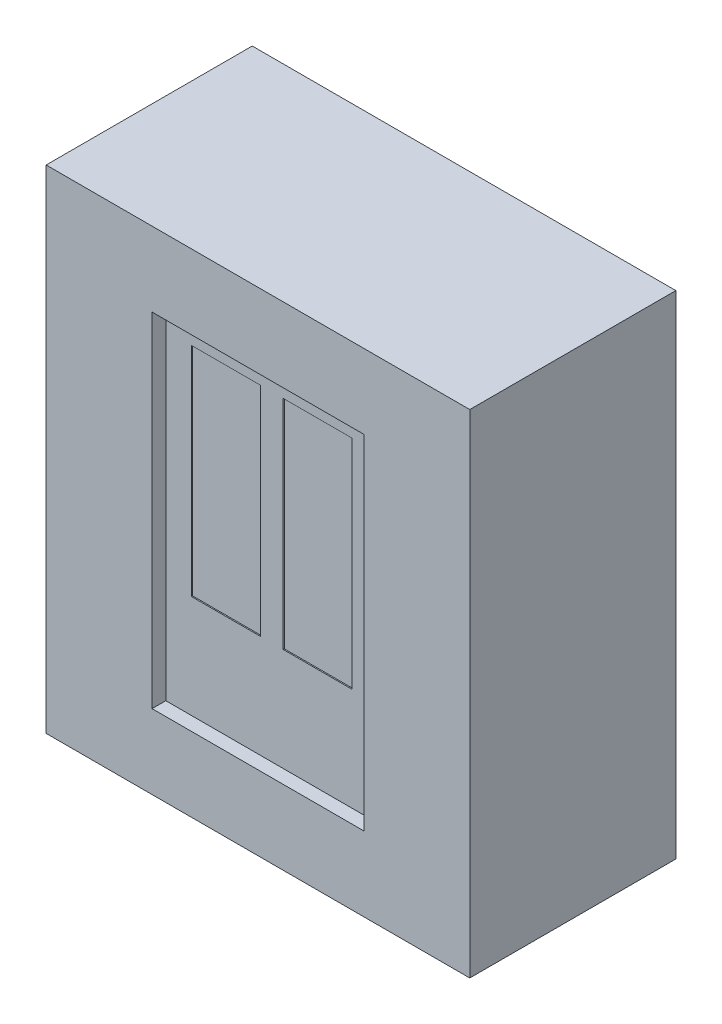
ISO-10303-21;
HEADER;
FILE_DESCRIPTION(('STEP AP214'),'2;1');
FILE_NAME('part.step','',(''),(''),'','','');
FILE_SCHEMA(('AUTOMOTIVE_DESIGN { 1 0 10303 214 1 1 1 1 }'));
ENDSEC;
DATA;
#1=APPLICATION_CONTEXT('core data for automotive mechanical design processes');
#2=APPLICATION_PROTOCOL_DEFINITION('international standard','automotive_design',2000,#1);
#3=PRODUCT_CONTEXT('',#1,'mechanical');
#4=PRODUCT('Part','Part','',(#3));
#5=PRODUCT_RELATED_PRODUCT_CATEGORY('part','',(#4));
#6=PRODUCT_DEFINITION_FORMATION('','',#4);
#7=PRODUCT_DEFINITION_CONTEXT('part definition',#1,'design');
#8=PRODUCT_DEFINITION('design','',#6,#7);
#9=PRODUCT_DEFINITION_SHAPE('','',#8);
#10=(LENGTH_UNIT() NAMED_UNIT(*) SI_UNIT(.MILLI.,.METRE.));
#11=(NAMED_UNIT(*) PLANE_ANGLE_UNIT() SI_UNIT($,.RADIAN.));
#12=(NAMED_UNIT(*) SI_UNIT($,.STERADIAN.) SOLID_ANGLE_UNIT());
#13=UNCERTAINTY_MEASURE_WITH_UNIT(LENGTH_MEASURE(1.E-05),#10,'distance_accuracy_value','');
#14=(GEOMETRIC_REPRESENTATION_CONTEXT(3) GLOBAL_UNCERTAINTY_ASSIGNED_CONTEXT((#13)) GLOBAL_UNIT_ASSIGNED_CONTEXT((#10,
#11,#12)) REPRESENTATION_CONTEXT('',''));
#15=CARTESIAN_POINT('',(0.,0.,0.));
#16=DIRECTION('',(0.,0.,1.));
#17=DIRECTION('',(1.,0.,0.));
#18=AXIS2_PLACEMENT_3D('',#15,#16,#17);
#19=CARTESIAN_POINT('',(0.,0.,180.));
#20=DIRECTION('',(1.,0.,0.));
#21=DIRECTION('',(0.,1.,0.));
#22=AXIS2_PLACEMENT_3D('',#19,#20,#21);
#23=PLANE('',#22);
#24=DIRECTION('',(0.,-1.,0.));
#25=VECTOR('',#24,1.);
#26=CARTESIAN_POINT('',(0.,0.,0.));
#27=LINE('',#26,#25);
#28=CARTESIAN_POINT('',(0.,0.,0.));
#29=VERTEX_POINT('',#28);
#30=CARTESIAN_POINT('',(0.,-430.,0.));
#31=VERTEX_POINT('',#30);
#32=EDGE_CURVE('E239',#29,#31,#27,.T.);
#33=ORIENTED_EDGE('',*,*,#32,.T.);
#34=DIRECTION('',(0.,0.,-1.));
#35=VECTOR('',#34,1.);
#36=CARTESIAN_POINT('',(0.,-430.,180.));
#37=LINE('',#36,#35);
#38=CARTESIAN_POINT('',(0.,-430.,180.));
#39=VERTEX_POINT('',#38);
#40=EDGE_CURVE('E11',#39,#31,#37,.T.);
#41=ORIENTED_EDGE('',*,*,#40,.F.);
#42=DIRECTION('',(0.,-1.,0.));
#43=VECTOR('',#42,1.);
#44=CARTESIAN_POINT('',(0.,0.,180.));
#45=LINE('',#44,#43);
#46=CARTESIAN_POINT('',(0.,0.,180.));
#47=VERTEX_POINT('',#46);
#48=EDGE_CURVE('E246',#47,#39,#45,.T.);
#49=ORIENTED_EDGE('',*,*,#48,.F.);
#50=DIRECTION('',(0.,0.,-1.));
#51=VECTOR('',#50,1.);
#52=CARTESIAN_POINT('',(0.,0.,180.));
#53=LINE('',#52,#51);
#54=EDGE_CURVE('E256',#47,#29,#53,.T.);
#55=ORIENTED_EDGE('',*,*,#54,.T.);
#56=EDGE_LOOP('',(#33,#41,#49,#55));
#57=FACE_BOUND('',#56,.T.);
#58=ADVANCED_FACE('F33',(#57),#23,.F.);
#59=CARTESIAN_POINT('',(0.,-430.,180.));
#60=DIRECTION('',(0.,1.,0.));
#61=DIRECTION('',(0.,0.,1.));
#62=AXIS2_PLACEMENT_3D('',#59,#60,#61);
#63=PLANE('',#62);
#64=DIRECTION('',(1.,0.,0.));
#65=VECTOR('',#64,1.);
#66=CARTESIAN_POINT('',(0.,-430.,0.));
#67=LINE('',#66,#65);
#68=CARTESIAN_POINT('',(370.,-430.,0.));
#69=VERTEX_POINT('',#68);
#70=EDGE_CURVE('E259',#31,#69,#67,.T.);
#71=ORIENTED_EDGE('',*,*,#70,.T.);
#72=DIRECTION('',(0.,0.,-1.));
#73=VECTOR('',#72,1.);
#74=CARTESIAN_POINT('',(370.,-430.,180.));
#75=LINE('',#74,#73);
#76=CARTESIAN_POINT('',(370.,-430.,180.));
#77=VERTEX_POINT('',#76);
#78=EDGE_CURVE('E40',#77,#69,#75,.T.);
#79=ORIENTED_EDGE('',*,*,#78,.F.);
#80=DIRECTION('',(1.,0.,0.));
#81=VECTOR('',#80,1.);
#82=CARTESIAN_POINT('',(0.,-430.,180.));
#83=LINE('',#82,#81);
#84=EDGE_CURVE('E249',#39,#77,#83,.T.);
#85=ORIENTED_EDGE('',*,*,#84,.F.);
#86=ORIENTED_EDGE('',*,*,#40,.T.);
#87=EDGE_LOOP('',(#71,#79,#85,#86));
#88=FACE_BOUND('',#87,.T.);
#89=ADVANCED_FACE('F289',(#88),#63,.F.);
#90=CARTESIAN_POINT('',(370.,0.,180.));
#91=DIRECTION('',(-1.,0.,0.));
#92=DIRECTION('',(0.,-1.,0.));
#93=AXIS2_PLACEMENT_3D('',#90,#91,#92);
#94=PLANE('',#93);
#95=DIRECTION('',(0.,1.,0.));
#96=VECTOR('',#95,1.);
#97=CARTESIAN_POINT('',(370.,0.,0.));
#98=LINE('',#97,#96);
#99=CARTESIAN_POINT('',(370.,0.,0.));
#100=VERTEX_POINT('',#99);
#101=EDGE_CURVE('E261',#69,#100,#98,.T.);
#102=ORIENTED_EDGE('',*,*,#101,.T.);
#103=DIRECTION('',(0.,0.,-1.));
#104=VECTOR('',#103,1.);
#105=CARTESIAN_POINT('',(370.,0.,180.));
#106=LINE('',#105,#104);
#107=CARTESIAN_POINT('',(370.,0.,180.));
#108=VERTEX_POINT('',#107);
#109=EDGE_CURVE('E266',#108,#100,#106,.T.);
#110=ORIENTED_EDGE('',*,*,#109,.F.);
#111=DIRECTION('',(0.,1.,0.));
#112=VECTOR('',#111,1.);
#113=CARTESIAN_POINT('',(370.,0.,180.));
#114=LINE('',#113,#112);
#115=EDGE_CURVE('E252',#77,#108,#114,.T.);
#116=ORIENTED_EDGE('',*,*,#115,.F.);
#117=ORIENTED_EDGE('',*,*,#78,.T.);
#118=EDGE_LOOP('',(#102,#110,#116,#117));
#119=FACE_BOUND('',#118,.T.);
#120=ADVANCED_FACE('F273',(#119),#94,.F.);
#121=CARTESIAN_POINT('',(0.,0.,180.));
#122=DIRECTION('',(0.,-1.,0.));
#123=DIRECTION('',(0.,0.,-1.));
#124=AXIS2_PLACEMENT_3D('',#121,#122,#123);
#125=PLANE('',#124);
#126=DIRECTION('',(-1.,0.,0.));
#127=VECTOR('',#126,1.);
#128=CARTESIAN_POINT('',(0.,0.,0.));
#129=LINE('',#128,#127);
#130=EDGE_CURVE('E250',#100,#29,#129,.T.);
#131=ORIENTED_EDGE('',*,*,#130,.T.);
#132=ORIENTED_EDGE('',*,*,#54,.F.);
#133=DIRECTION('',(-1.,0.,0.));
#134=VECTOR('',#133,1.);
#135=CARTESIAN_POINT('',(0.,0.,180.));
#136=LINE('',#135,#134);
#137=EDGE_CURVE('E254',#108,#47,#136,.T.);
#138=ORIENTED_EDGE('',*,*,#137,.F.);
#139=ORIENTED_EDGE('',*,*,#109,.T.);
#140=EDGE_LOOP('',(#131,#132,#138,#139));
#141=FACE_BOUND('',#140,.T.);
#142=ADVANCED_FACE('F282',(#141),#125,.F.);
#143=CARTESIAN_POINT('',(0.,0.,180.));
#144=DIRECTION('',(0.,0.,1.));
#145=DIRECTION('',(1.,0.,0.));
#146=AXIS2_PLACEMENT_3D('',#143,#144,#145);
#147=PLANE('',#146);
#148=DIRECTION('',(0.,1.,0.));
#149=VECTOR('',#148,1.);
#150=CARTESIAN_POINT('',(277.5,-65.,180.));
#151=LINE('',#150,#149);
#152=CARTESIAN_POINT('',(277.5,-365.,180.));
#153=VERTEX_POINT('',#152);
#154=CARTESIAN_POINT('',(277.5,-65.,180.));
#155=VERTEX_POINT('',#154);
#156=EDGE_CURVE('E208',#153,#155,#151,.T.);
#157=ORIENTED_EDGE('',*,*,#156,.F.);
#158=DIRECTION('',(1.,0.,0.));
#159=VECTOR('',#158,1.);
#160=CARTESIAN_POINT('',(92.5000000000001,-365.,180.));
#161=LINE('',#160,#159);
#162=CARTESIAN_POINT('',(92.5000000000001,-365.,180.));
#163=VERTEX_POINT('',#162);
#164=EDGE_CURVE('E218',#163,#153,#161,.T.);
#165=ORIENTED_EDGE('',*,*,#164,.F.);
#166=DIRECTION('',(0.,-1.,0.));
#167=VECTOR('',#166,1.);
#168=CARTESIAN_POINT('',(92.5000000000001,-65.,180.));
#169=LINE('',#168,#167);
#170=CARTESIAN_POINT('',(92.5000000000001,-65.,180.));
#171=VERTEX_POINT('',#170);
#172=EDGE_CURVE('E232',#171,#163,#169,.T.);
#173=ORIENTED_EDGE('',*,*,#172,.F.);
#174=DIRECTION('',(-1.,0.,0.));
#175=VECTOR('',#174,1.);
#176=CARTESIAN_POINT('',(92.5000000000001,-65.,180.));
#177=LINE('',#176,#175);
#178=EDGE_CURVE('E229',#155,#171,#177,.T.);
#179=ORIENTED_EDGE('',*,*,#178,.F.);
#180=EDGE_LOOP('',(#157,#165,#173,#179));
#181=FACE_BOUND('',#180,.T.);
#182=ORIENTED_EDGE('',*,*,#48,.T.);
#183=ORIENTED_EDGE('',*,*,#84,.T.);
#184=ORIENTED_EDGE('',*,*,#115,.T.);
#185=ORIENTED_EDGE('',*,*,#137,.T.);
#186=EDGE_LOOP('',(#182,#183,#184,#185));
#187=FACE_BOUND('',#186,.T.);
#188=ADVANCED_FACE('F288',(#181,#187),#147,.T.);
#189=CARTESIAN_POINT('',(0.,0.,0.));
#190=DIRECTION('',(0.,0.,1.));
#191=DIRECTION('',(1.,0.,0.));
#192=AXIS2_PLACEMENT_3D('',#189,#190,#191);
#193=PLANE('',#192);
#194=ORIENTED_EDGE('',*,*,#32,.F.);
#195=ORIENTED_EDGE('',*,*,#130,.F.);
#196=ORIENTED_EDGE('',*,*,#101,.F.);
#197=ORIENTED_EDGE('',*,*,#70,.F.);
#198=EDGE_LOOP('',(#194,#195,#196,#197));
#199=FACE_BOUND('',#198,.T.);
#200=ADVANCED_FACE('F279',(#199),#193,.F.);
#201=CARTESIAN_POINT('',(277.5,-65.,168.));
#202=DIRECTION('',(1.,0.,0.));
#203=DIRECTION('',(0.,1.,0.));
#204=AXIS2_PLACEMENT_3D('',#201,#202,#203);
#205=PLANE('',#204);
#206=ORIENTED_EDGE('',*,*,#156,.T.);
#207=DIRECTION('',(0.,0.,1.));
#208=VECTOR('',#207,1.);
#209=CARTESIAN_POINT('',(277.5,-65.,168.));
#210=LINE('',#209,#208);
#211=CARTESIAN_POINT('',(277.5,-65.,168.));
#212=VERTEX_POINT('',#211);
#213=EDGE_CURVE('E227',#212,#155,#210,.T.);
#214=ORIENTED_EDGE('',*,*,#213,.F.);
#215=DIRECTION('',(0.,1.,0.));
#216=VECTOR('',#215,1.);
#217=CARTESIAN_POINT('',(277.5,-65.,168.));
#218=LINE('',#217,#216);
#219=CARTESIAN_POINT('',(277.5,-365.,168.));
#220=VERTEX_POINT('',#219);
#221=EDGE_CURVE('E214',#220,#212,#218,.T.);
#222=ORIENTED_EDGE('',*,*,#221,.F.);
#223=DIRECTION('',(0.,0.,1.));
#224=VECTOR('',#223,1.);
#225=CARTESIAN_POINT('',(277.5,-365.,168.));
#226=LINE('',#225,#224);
#227=EDGE_CURVE('E237',#220,#153,#226,.T.);
#228=ORIENTED_EDGE('',*,*,#227,.T.);
#229=EDGE_LOOP('',(#206,#214,#222,#228));
#230=FACE_BOUND('',#229,.T.);
#231=ADVANCED_FACE('F301',(#230),#205,.F.);
#232=CARTESIAN_POINT('',(92.5000000000001,-365.,168.));
#233=DIRECTION('',(0.,-1.,0.));
#234=DIRECTION('',(0.,0.,-1.));
#235=AXIS2_PLACEMENT_3D('',#232,#233,#234);
#236=PLANE('',#235);
#237=ORIENTED_EDGE('',*,*,#164,.T.);
#238=ORIENTED_EDGE('',*,*,#227,.F.);
#239=DIRECTION('',(1.,0.,0.));
#240=VECTOR('',#239,1.);
#241=CARTESIAN_POINT('',(92.5000000000001,-365.,168.));
#242=LINE('',#241,#240);
#243=CARTESIAN_POINT('',(92.5000000000001,-365.,168.));
#244=VERTEX_POINT('',#243);
#245=EDGE_CURVE('E224',#244,#220,#242,.T.);
#246=ORIENTED_EDGE('',*,*,#245,.F.);
#247=DIRECTION('',(0.,0.,1.));
#248=VECTOR('',#247,1.);
#249=CARTESIAN_POINT('',(92.5000000000001,-365.,168.));
#250=LINE('',#249,#248);
#251=EDGE_CURVE('E240',#244,#163,#250,.T.);
#252=ORIENTED_EDGE('',*,*,#251,.T.);
#253=EDGE_LOOP('',(#237,#238,#246,#252));
#254=FACE_BOUND('',#253,.T.);
#255=ADVANCED_FACE('F307',(#254),#236,.F.);
#256=CARTESIAN_POINT('',(92.5000000000001,-65.,168.));
#257=DIRECTION('',(-1.,0.,0.));
#258=DIRECTION('',(0.,-1.,0.));
#259=AXIS2_PLACEMENT_3D('',#256,#257,#258);
#260=PLANE('',#259);
#261=ORIENTED_EDGE('',*,*,#172,.T.);
#262=ORIENTED_EDGE('',*,*,#251,.F.);
#263=DIRECTION('',(0.,-1.,0.));
#264=VECTOR('',#263,1.);
#265=CARTESIAN_POINT('',(92.5000000000001,-65.,168.));
#266=LINE('',#265,#264);
#267=CARTESIAN_POINT('',(92.5000000000001,-65.,168.));
#268=VERTEX_POINT('',#267);
#269=EDGE_CURVE('E221',#268,#244,#266,.T.);
#270=ORIENTED_EDGE('',*,*,#269,.F.);
#271=DIRECTION('',(0.,0.,1.));
#272=VECTOR('',#271,1.);
#273=CARTESIAN_POINT('',(92.5000000000001,-65.,168.));
#274=LINE('',#273,#272);
#275=EDGE_CURVE('E242',#268,#171,#274,.T.);
#276=ORIENTED_EDGE('',*,*,#275,.T.);
#277=EDGE_LOOP('',(#261,#262,#270,#276));
#278=FACE_BOUND('',#277,.T.);
#279=ADVANCED_FACE('F313',(#278),#260,.F.);
#280=CARTESIAN_POINT('',(92.5000000000001,-65.,168.));
#281=DIRECTION('',(0.,1.,0.));
#282=DIRECTION('',(0.,0.,1.));
#283=AXIS2_PLACEMENT_3D('',#280,#281,#282);
#284=PLANE('',#283);
#285=ORIENTED_EDGE('',*,*,#178,.T.);
#286=ORIENTED_EDGE('',*,*,#275,.F.);
#287=DIRECTION('',(-1.,0.,0.));
#288=VECTOR('',#287,1.);
#289=CARTESIAN_POINT('',(92.5000000000001,-65.,168.));
#290=LINE('',#289,#288);
#291=EDGE_CURVE('E217',#212,#268,#290,.T.);
#292=ORIENTED_EDGE('',*,*,#291,.F.);
#293=ORIENTED_EDGE('',*,*,#213,.T.);
#294=EDGE_LOOP('',(#285,#286,#292,#293));
#295=FACE_BOUND('',#294,.T.);
#296=ADVANCED_FACE('F309',(#295),#284,.F.);
#297=CARTESIAN_POINT('',(0.,0.,168.));
#298=DIRECTION('',(0.,0.,1.));
#299=DIRECTION('',(1.,0.,0.));
#300=AXIS2_PLACEMENT_3D('',#297,#298,#299);
#301=PLANE('',#300);
#302=DIRECTION('',(-1.,0.,0.));
#303=VECTOR('',#302,1.);
#304=CARTESIAN_POINT('',(195.,-85.0000000000001,168.));
#305=LINE('',#304,#303);
#306=CARTESIAN_POINT('',(255.,-85.0000000000001,168.));
#307=VERTEX_POINT('',#306);
#308=CARTESIAN_POINT('',(195.,-85.0000000000001,168.));
#309=VERTEX_POINT('',#308);
#310=EDGE_CURVE('E47',#307,#309,#305,.T.);
#311=ORIENTED_EDGE('',*,*,#310,.F.);
#312=DIRECTION('',(0.,1.,0.));
#313=VECTOR('',#312,1.);
#314=CARTESIAN_POINT('',(255.,-85.0000000000001,168.));
#315=LINE('',#314,#313);
#316=CARTESIAN_POINT('',(255.,-275.,168.));
#317=VERTEX_POINT('',#316);
#318=EDGE_CURVE('E165',#317,#307,#315,.T.);
#319=ORIENTED_EDGE('',*,*,#318,.F.);
#320=DIRECTION('',(1.,0.,0.));
#321=VECTOR('',#320,1.);
#322=CARTESIAN_POINT('',(195.,-275.,168.));
#323=LINE('',#322,#321);
#324=CARTESIAN_POINT('',(195.,-275.,168.));
#325=VERTEX_POINT('',#324);
#326=EDGE_CURVE('E168',#325,#317,#323,.T.);
#327=ORIENTED_EDGE('',*,*,#326,.F.);
#328=DIRECTION('',(0.,-1.,0.));
#329=VECTOR('',#328,1.);
#330=CARTESIAN_POINT('',(195.,-85.0000000000001,168.));
#331=LINE('',#330,#329);
#332=EDGE_CURVE('E174',#309,#325,#331,.T.);
#333=ORIENTED_EDGE('',*,*,#332,.F.);
#334=EDGE_LOOP('',(#311,#319,#327,#333));
#335=FACE_BOUND('',#334,.T.);
#336=DIRECTION('',(0.,1.,0.));
#337=VECTOR('',#336,1.);
#338=CARTESIAN_POINT('',(175.,-85.0000000000001,168.));
#339=LINE('',#338,#337);
#340=CARTESIAN_POINT('',(175.,-275.,168.));
#341=VERTEX_POINT('',#340);
#342=CARTESIAN_POINT('',(175.,-85.0000000000001,168.));
#343=VERTEX_POINT('',#342);
#344=EDGE_CURVE('E55',#341,#343,#339,.T.);
#345=ORIENTED_EDGE('',*,*,#344,.F.);
#346=DIRECTION('',(1.,0.,0.));
#347=VECTOR('',#346,1.);
#348=CARTESIAN_POINT('',(175.,-275.,168.));
#349=LINE('',#348,#347);
#350=CARTESIAN_POINT('',(115.,-275.,168.));
#351=VERTEX_POINT('',#350);
#352=EDGE_CURVE('E187',#351,#341,#349,.T.);
#353=ORIENTED_EDGE('',*,*,#352,.F.);
#354=DIRECTION('',(0.,-1.,0.));
#355=VECTOR('',#354,1.);
#356=CARTESIAN_POINT('',(115.,-85.0000000000001,168.));
#357=LINE('',#356,#355);
#358=CARTESIAN_POINT('',(115.,-85.0000000000001,168.));
#359=VERTEX_POINT('',#358);
#360=EDGE_CURVE('E201',#359,#351,#357,.T.);
#361=ORIENTED_EDGE('',*,*,#360,.F.);
#362=DIRECTION('',(-1.,0.,0.));
#363=VECTOR('',#362,1.);
#364=CARTESIAN_POINT('',(175.,-85.0000000000001,168.));
#365=LINE('',#364,#363);
#366=EDGE_CURVE('E198',#343,#359,#365,.T.);
#367=ORIENTED_EDGE('',*,*,#366,.F.);
#368=EDGE_LOOP('',(#345,#353,#361,#367));
#369=FACE_BOUND('',#368,.T.);
#370=ORIENTED_EDGE('',*,*,#221,.T.);
#371=ORIENTED_EDGE('',*,*,#291,.T.);
#372=ORIENTED_EDGE('',*,*,#269,.T.);
#373=ORIENTED_EDGE('',*,*,#245,.T.);
#374=EDGE_LOOP('',(#370,#371,#372,#373));
#375=FACE_BOUND('',#374,.T.);
#376=ADVANCED_FACE('F312',(#335,#369,#375),#301,.T.);
#377=CARTESIAN_POINT('',(175.,-85.0000000000001,167.));
#378=DIRECTION('',(1.,0.,0.));
#379=DIRECTION('',(0.,1.,0.));
#380=AXIS2_PLACEMENT_3D('',#377,#378,#379);
#381=PLANE('',#380);
#382=ORIENTED_EDGE('',*,*,#344,.T.);
#383=DIRECTION('',(0.,0.,1.));
#384=VECTOR('',#383,1.);
#385=CARTESIAN_POINT('',(175.,-85.0000000000001,167.));
#386=LINE('',#385,#384);
#387=CARTESIAN_POINT('',(175.,-85.0000000000001,167.));
#388=VERTEX_POINT('',#387);
#389=EDGE_CURVE('E196',#388,#343,#386,.T.);
#390=ORIENTED_EDGE('',*,*,#389,.F.);
#391=DIRECTION('',(0.,1.,0.));
#392=VECTOR('',#391,1.);
#393=CARTESIAN_POINT('',(175.,-85.0000000000001,167.));
#394=LINE('',#393,#392);
#395=CARTESIAN_POINT('',(175.,-275.,167.));
#396=VERTEX_POINT('',#395);
#397=EDGE_CURVE('E183',#396,#388,#394,.T.);
#398=ORIENTED_EDGE('',*,*,#397,.F.);
#399=DIRECTION('',(0.,0.,1.));
#400=VECTOR('',#399,1.);
#401=CARTESIAN_POINT('',(175.,-275.,167.));
#402=LINE('',#401,#400);
#403=EDGE_CURVE('E206',#396,#341,#402,.T.);
#404=ORIENTED_EDGE('',*,*,#403,.T.);
#405=EDGE_LOOP('',(#382,#390,#398,#404));
#406=FACE_BOUND('',#405,.T.);
#407=ADVANCED_FACE('F323',(#406),#381,.F.);
#408=CARTESIAN_POINT('',(175.,-275.,167.));
#409=DIRECTION('',(0.,-1.,0.));
#410=DIRECTION('',(0.,0.,-1.));
#411=AXIS2_PLACEMENT_3D('',#408,#409,#410);
#412=PLANE('',#411);
#413=ORIENTED_EDGE('',*,*,#352,.T.);
#414=ORIENTED_EDGE('',*,*,#403,.F.);
#415=DIRECTION('',(1.,0.,0.));
#416=VECTOR('',#415,1.);
#417=CARTESIAN_POINT('',(175.,-275.,167.));
#418=LINE('',#417,#416);
#419=CARTESIAN_POINT('',(115.,-275.,167.));
#420=VERTEX_POINT('',#419);
#421=EDGE_CURVE('E193',#420,#396,#418,.T.);
#422=ORIENTED_EDGE('',*,*,#421,.F.);
#423=DIRECTION('',(0.,0.,1.));
#424=VECTOR('',#423,1.);
#425=CARTESIAN_POINT('',(115.,-275.,167.));
#426=LINE('',#425,#424);
#427=EDGE_CURVE('E209',#420,#351,#426,.T.);
#428=ORIENTED_EDGE('',*,*,#427,.T.);
#429=EDGE_LOOP('',(#413,#414,#422,#428));
#430=FACE_BOUND('',#429,.T.);
#431=ADVANCED_FACE('F327',(#430),#412,.F.);
#432=CARTESIAN_POINT('',(115.,-85.0000000000001,167.));
#433=DIRECTION('',(-1.,0.,0.));
#434=DIRECTION('',(0.,-1.,0.));
#435=AXIS2_PLACEMENT_3D('',#432,#433,#434);
#436=PLANE('',#435);
#437=ORIENTED_EDGE('',*,*,#360,.T.);
#438=ORIENTED_EDGE('',*,*,#427,.F.);
#439=DIRECTION('',(0.,-1.,0.));
#440=VECTOR('',#439,1.);
#441=CARTESIAN_POINT('',(115.,-85.0000000000001,167.));
#442=LINE('',#441,#440);
#443=CARTESIAN_POINT('',(115.,-85.0000000000001,167.));
#444=VERTEX_POINT('',#443);
#445=EDGE_CURVE('E190',#444,#420,#442,.T.);
#446=ORIENTED_EDGE('',*,*,#445,.F.);
#447=DIRECTION('',(0.,0.,1.));
#448=VECTOR('',#447,1.);
#449=CARTESIAN_POINT('',(115.,-85.0000000000001,167.));
#450=LINE('',#449,#448);
#451=EDGE_CURVE('E211',#444,#359,#450,.T.);
#452=ORIENTED_EDGE('',*,*,#451,.T.);
#453=EDGE_LOOP('',(#437,#438,#446,#452));
#454=FACE_BOUND('',#453,.T.);
#455=ADVANCED_FACE('F332',(#454),#436,.F.);
#456=CARTESIAN_POINT('',(175.,-85.0000000000001,167.));
#457=DIRECTION('',(0.,1.,0.));
#458=DIRECTION('',(0.,0.,1.));
#459=AXIS2_PLACEMENT_3D('',#456,#457,#458);
#460=PLANE('',#459);
#461=ORIENTED_EDGE('',*,*,#366,.T.);
#462=ORIENTED_EDGE('',*,*,#451,.F.);
#463=DIRECTION('',(-1.,0.,0.));
#464=VECTOR('',#463,1.);
#465=CARTESIAN_POINT('',(175.,-85.0000000000001,167.));
#466=LINE('',#465,#464);
#467=EDGE_CURVE('E186',#388,#444,#466,.T.);
#468=ORIENTED_EDGE('',*,*,#467,.F.);
#469=ORIENTED_EDGE('',*,*,#389,.T.);
#470=EDGE_LOOP('',(#461,#462,#468,#469));
#471=FACE_BOUND('',#470,.T.);
#472=ADVANCED_FACE('F328',(#471),#460,.F.);
#473=CARTESIAN_POINT('',(0.,0.,167.));
#474=DIRECTION('',(0.,0.,-1.));
#475=DIRECTION('',(-1.,0.,0.));
#476=AXIS2_PLACEMENT_3D('',#473,#474,#475);
#477=PLANE('',#476);
#478=ORIENTED_EDGE('',*,*,#397,.T.);
#479=ORIENTED_EDGE('',*,*,#467,.T.);
#480=ORIENTED_EDGE('',*,*,#445,.T.);
#481=ORIENTED_EDGE('',*,*,#421,.T.);
#482=EDGE_LOOP('',(#478,#479,#480,#481));
#483=FACE_BOUND('',#482,.T.);
#484=ADVANCED_FACE('F331',(#483),#477,.F.);
#485=CARTESIAN_POINT('',(195.,-85.0000000000001,167.));
#486=DIRECTION('',(0.,1.,0.));
#487=DIRECTION('',(-1.,0.,0.));
#488=AXIS2_PLACEMENT_3D('',#485,#486,#487);
#489=PLANE('',#488);
#490=ORIENTED_EDGE('',*,*,#310,.T.);
#491=DIRECTION('',(0.,0.,1.));
#492=VECTOR('',#491,1.);
#493=CARTESIAN_POINT('',(195.,-85.0000000000001,167.));
#494=LINE('',#493,#492);
#495=CARTESIAN_POINT('',(195.,-85.0000000000001,167.));
#496=VERTEX_POINT('',#495);
#497=EDGE_CURVE('E143',#496,#309,#494,.T.);
#498=ORIENTED_EDGE('',*,*,#497,.F.);
#499=DIRECTION('',(-1.,0.,0.));
#500=VECTOR('',#499,1.);
#501=CARTESIAN_POINT('',(195.,-85.0000000000001,167.));
#502=LINE('',#501,#500);
#503=CARTESIAN_POINT('',(255.,-85.0000000000001,167.));
#504=VERTEX_POINT('',#503);
#505=EDGE_CURVE('E147',#504,#496,#502,.T.);
#506=ORIENTED_EDGE('',*,*,#505,.F.);
#507=DIRECTION('',(0.,0.,1.));
#508=VECTOR('',#507,1.);
#509=CARTESIAN_POINT('',(255.,-85.0000000000001,167.));
#510=LINE('',#509,#508);
#511=EDGE_CURVE('E178',#504,#307,#510,.T.);
#512=ORIENTED_EDGE('',*,*,#511,.T.);
#513=EDGE_LOOP('',(#490,#498,#506,#512));
#514=FACE_BOUND('',#513,.T.);
#515=ADVANCED_FACE('F145',(#514),#489,.F.);
#516=CARTESIAN_POINT('',(255.,-85.0000000000001,167.));
#517=DIRECTION('',(1.,0.,0.));
#518=DIRECTION('',(0.,0.,-1.));
#519=AXIS2_PLACEMENT_3D('',#516,#517,#518);
#520=PLANE('',#519);
#521=ORIENTED_EDGE('',*,*,#318,.T.);
#522=ORIENTED_EDGE('',*,*,#511,.F.);
#523=DIRECTION('',(0.,1.,0.));
#524=VECTOR('',#523,1.);
#525=CARTESIAN_POINT('',(255.,-85.0000000000001,167.));
#526=LINE('',#525,#524);
#527=CARTESIAN_POINT('',(255.,-275.,167.));
#528=VERTEX_POINT('',#527);
#529=EDGE_CURVE('E153',#528,#504,#526,.T.);
#530=ORIENTED_EDGE('',*,*,#529,.F.);
#531=DIRECTION('',(0.,0.,1.));
#532=VECTOR('',#531,1.);
#533=CARTESIAN_POINT('',(255.,-275.,167.));
#534=LINE('',#533,#532);
#535=EDGE_CURVE('E180',#528,#317,#534,.T.);
#536=ORIENTED_EDGE('',*,*,#535,.T.);
#537=EDGE_LOOP('',(#521,#522,#530,#536));
#538=FACE_BOUND('',#537,.T.);
#539=ADVANCED_FACE('F345',(#538),#520,.F.);
#540=CARTESIAN_POINT('',(195.,-275.,167.));
#541=DIRECTION('',(0.,-1.,0.));
#542=DIRECTION('',(0.,0.,-1.));
#543=AXIS2_PLACEMENT_3D('',#540,#541,#542);
#544=PLANE('',#543);
#545=ORIENTED_EDGE('',*,*,#326,.T.);
#546=ORIENTED_EDGE('',*,*,#535,.F.);
#547=DIRECTION('',(1.,0.,0.));
#548=VECTOR('',#547,1.);
#549=CARTESIAN_POINT('',(195.,-275.,167.));
#550=LINE('',#549,#548);
#551=CARTESIAN_POINT('',(195.,-275.,167.));
#552=VERTEX_POINT('',#551);
#553=EDGE_CURVE('E161',#552,#528,#550,.T.);
#554=ORIENTED_EDGE('',*,*,#553,.F.);
#555=DIRECTION('',(0.,0.,1.));
#556=VECTOR('',#555,1.);
#557=CARTESIAN_POINT('',(195.,-275.,167.));
#558=LINE('',#557,#556);
#559=EDGE_CURVE('E152',#552,#325,#558,.T.);
#560=ORIENTED_EDGE('',*,*,#559,.T.);
#561=EDGE_LOOP('',(#545,#546,#554,#560));
#562=FACE_BOUND('',#561,.T.);
#563=ADVANCED_FACE('F348',(#562),#544,.F.);
#564=CARTESIAN_POINT('',(195.,-85.0000000000001,167.));
#565=DIRECTION('',(-1.,0.,0.));
#566=DIRECTION('',(0.,-1.,0.));
#567=AXIS2_PLACEMENT_3D('',#564,#565,#566);
#568=PLANE('',#567);
#569=ORIENTED_EDGE('',*,*,#332,.T.);
#570=ORIENTED_EDGE('',*,*,#559,.F.);
#571=DIRECTION('',(0.,-1.,0.));
#572=VECTOR('',#571,1.);
#573=CARTESIAN_POINT('',(195.,-85.0000000000001,167.));
#574=LINE('',#573,#572);
#575=EDGE_CURVE('E156',#496,#552,#574,.T.);
#576=ORIENTED_EDGE('',*,*,#575,.F.);
#577=ORIENTED_EDGE('',*,*,#497,.T.);
#578=EDGE_LOOP('',(#569,#570,#576,#577));
#579=FACE_BOUND('',#578,.T.);
#580=ADVANCED_FACE('F157',(#579),#568,.F.);
#581=CARTESIAN_POINT('',(0.,0.,167.));
#582=DIRECTION('',(0.,0.,-1.));
#583=DIRECTION('',(-1.,0.,0.));
#584=AXIS2_PLACEMENT_3D('',#581,#582,#583);
#585=PLANE('',#584);
#586=ORIENTED_EDGE('',*,*,#505,.T.);
#587=ORIENTED_EDGE('',*,*,#575,.T.);
#588=ORIENTED_EDGE('',*,*,#553,.T.);
#589=ORIENTED_EDGE('',*,*,#529,.T.);
#590=EDGE_LOOP('',(#586,#587,#588,#589));
#591=FACE_BOUND('',#590,.T.);
#592=ADVANCED_FACE('F163',(#591),#585,.F.);
#593=CLOSED_SHELL('',(#58,#89,#120,#142,#188,#200,#231,#255,#279,#296,#376,#407,#431,#455,#472,
#484,#515,#539,#563,#580,#592));
#594=MANIFOLD_SOLID_BREP('B2',#593);
#595=ADVANCED_BREP_SHAPE_REPRESENTATION('',(#18,#594),#14);
#596=SHAPE_DEFINITION_REPRESENTATION(#9,#595);
ENDSEC;
END-ISO-10303-21;
